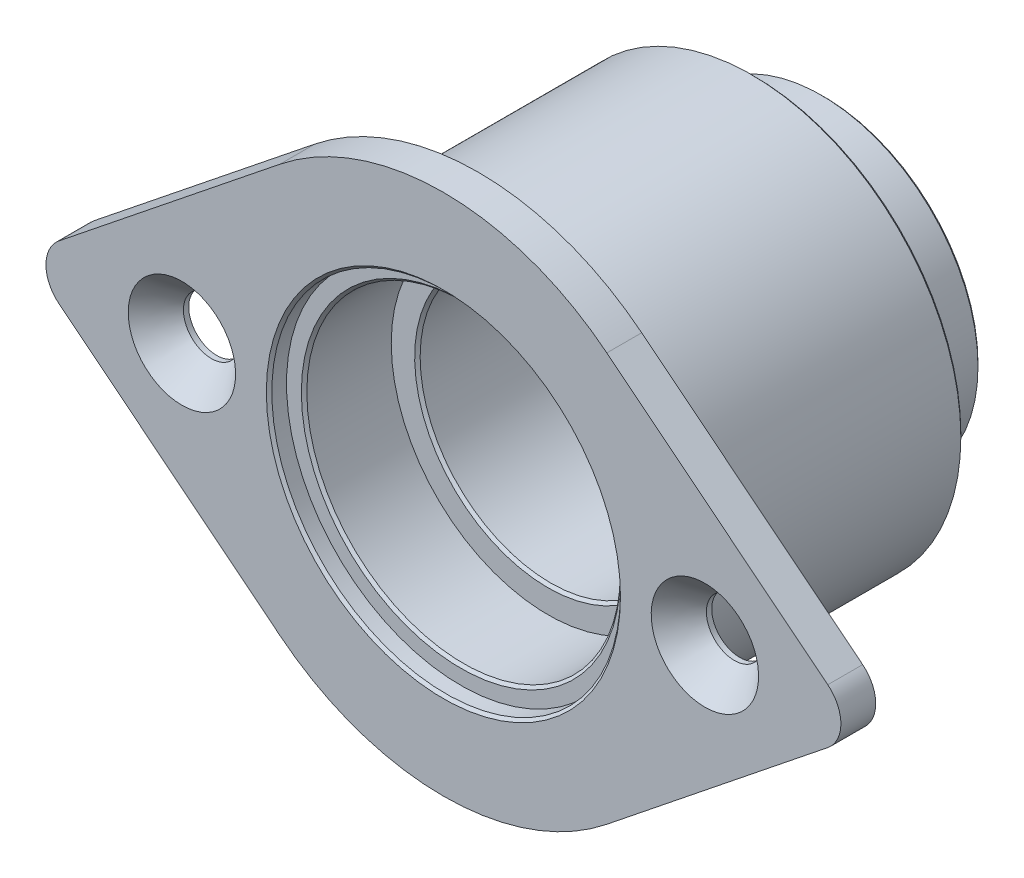
ISO-10303-21;
HEADER;
FILE_DESCRIPTION(('STEP AP214'),'2;1');
FILE_NAME('part.step','',(''),(''),'','','');
FILE_SCHEMA(('AUTOMOTIVE_DESIGN { 1 0 10303 214 1 1 1 1 }'));
ENDSEC;
DATA;
#1=APPLICATION_CONTEXT('core data for automotive mechanical design processes');
#2=APPLICATION_PROTOCOL_DEFINITION('international standard','automotive_design',2000,#1);
#3=PRODUCT_CONTEXT('',#1,'mechanical');
#4=PRODUCT('Part','Part','',(#3));
#5=PRODUCT_RELATED_PRODUCT_CATEGORY('part','',(#4));
#6=PRODUCT_DEFINITION_FORMATION('','',#4);
#7=PRODUCT_DEFINITION_CONTEXT('part definition',#1,'design');
#8=PRODUCT_DEFINITION('design','',#6,#7);
#9=PRODUCT_DEFINITION_SHAPE('','',#8);
#10=(LENGTH_UNIT() NAMED_UNIT(*) SI_UNIT(.MILLI.,.METRE.));
#11=(NAMED_UNIT(*) PLANE_ANGLE_UNIT() SI_UNIT($,.RADIAN.));
#12=(NAMED_UNIT(*) SI_UNIT($,.STERADIAN.) SOLID_ANGLE_UNIT());
#13=UNCERTAINTY_MEASURE_WITH_UNIT(LENGTH_MEASURE(1.E-05),#10,'distance_accuracy_value','');
#14=(GEOMETRIC_REPRESENTATION_CONTEXT(3) GLOBAL_UNCERTAINTY_ASSIGNED_CONTEXT((#13)) GLOBAL_UNIT_ASSIGNED_CONTEXT((#10,
#11,#12)) REPRESENTATION_CONTEXT('',''));
#15=CARTESIAN_POINT('',(0.,0.,0.));
#16=DIRECTION('',(0.,0.,1.));
#17=DIRECTION('',(1.,0.,0.));
#18=AXIS2_PLACEMENT_3D('',#15,#16,#17);
#19=CARTESIAN_POINT('',(0.,0.,-7.9375));
#20=DIRECTION('',(0.,0.,1.));
#21=DIRECTION('',(1.,0.,0.));
#22=AXIS2_PLACEMENT_3D('',#19,#20,#21);
#23=PLANE('',#22);
#24=CARTESIAN_POINT('',(0.,0.,-7.9375));
#25=DIRECTION('',(0.,0.,-1.));
#26=DIRECTION('',(-1.,0.,0.));
#27=AXIS2_PLACEMENT_3D('',#24,#25,#26);
#28=CIRCLE('',#27,14.2748);
#29=CARTESIAN_POINT('',(-14.2748,0.,-7.9375));
#30=VERTEX_POINT('',#29);
#31=EDGE_CURVE('E137',#30,#30,#28,.F.);
#32=ORIENTED_EDGE('',*,*,#31,.T.);
#33=EDGE_LOOP('',(#32));
#34=FACE_BOUND('',#33,.T.);
#35=CARTESIAN_POINT('',(0.,0.,-7.9375));
#36=DIRECTION('',(0.,0.,1.));
#37=DIRECTION('',(0.,-1.,0.));
#38=AXIS2_PLACEMENT_3D('',#35,#36,#37);
#39=CIRCLE('',#38,12.1435499999999);
#40=CARTESIAN_POINT('',(0.,-12.1435499999999,-7.9375));
#41=VERTEX_POINT('',#40);
#42=EDGE_CURVE('E21',#41,#41,#39,.F.);
#43=ORIENTED_EDGE('',*,*,#42,.T.);
#44=EDGE_LOOP('',(#43));
#45=FACE_BOUND('',#44,.T.);
#46=ADVANCED_FACE('F18',(#34,#45),#23,.T.);
#47=CARTESIAN_POINT('',(0.,0.,-7.9375));
#48=DIRECTION('',(0.,0.,1.));
#49=DIRECTION('',(0.,-1.,0.));
#50=AXIS2_PLACEMENT_3D('',#47,#48,#49);
#51=CONICAL_SURFACE('',#50,12.1435499999999,0.785398163397434);
#52=CARTESIAN_POINT('',(0.,0.,-8.18749999999995));
#53=DIRECTION('',(0.,0.,-1.));
#54=DIRECTION('',(-1.,0.,0.));
#55=AXIS2_PLACEMENT_3D('',#52,#53,#54);
#56=CIRCLE('',#55,11.89355);
#57=CARTESIAN_POINT('',(-11.89355,0.,-8.18749999999995));
#58=VERTEX_POINT('',#57);
#59=EDGE_CURVE('E135',#58,#58,#56,.T.);
#60=ORIENTED_EDGE('',*,*,#59,.T.);
#61=EDGE_LOOP('',(#60));
#62=FACE_BOUND('',#61,.T.);
#63=ORIENTED_EDGE('',*,*,#42,.F.);
#64=EDGE_LOOP('',(#63));
#65=FACE_BOUND('',#64,.T.);
#66=ADVANCED_FACE('F196',(#62,#65),#51,.F.);
#67=CARTESIAN_POINT('',(0.,0.,1.5875));
#68=DIRECTION('',(0.,0.,-1.));
#69=DIRECTION('',(-1.,0.,0.));
#70=AXIS2_PLACEMENT_3D('',#67,#68,#69);
#71=CYLINDRICAL_SURFACE('',#70,14.2748);
#72=CARTESIAN_POINT('',(0.,0.,-0.249999999999985));
#73=DIRECTION('',(0.,0.,1.));
#74=DIRECTION('',(1.,0.,0.));
#75=AXIS2_PLACEMENT_3D('',#72,#73,#74);
#76=CIRCLE('',#75,14.2748);
#77=CARTESIAN_POINT('',(14.2748,0.,-0.249999999999985));
#78=VERTEX_POINT('',#77);
#79=EDGE_CURVE('E132',#78,#78,#76,.T.);
#80=ORIENTED_EDGE('',*,*,#79,.T.);
#81=EDGE_LOOP('',(#80));
#82=FACE_BOUND('',#81,.T.);
#83=ORIENTED_EDGE('',*,*,#31,.F.);
#84=EDGE_LOOP('',(#83));
#85=FACE_BOUND('',#84,.T.);
#86=ADVANCED_FACE('F198',(#82,#85),#71,.F.);
#87=CARTESIAN_POINT('',(0.,0.,38.7877315203269));
#88=DIRECTION('',(0.,0.,-1.));
#89=DIRECTION('',(-1.,0.,0.));
#90=AXIS2_PLACEMENT_3D('',#87,#88,#89);
#91=CYLINDRICAL_SURFACE('',#90,11.89355);
#92=ORIENTED_EDGE('',*,*,#59,.F.);
#93=EDGE_LOOP('',(#92));
#94=FACE_BOUND('',#93,.T.);
#95=CARTESIAN_POINT('',(0.,0.,-32.8334999999999));
#96=DIRECTION('',(0.,0.,-1.));
#97=DIRECTION('',(-1.,0.,0.));
#98=AXIS2_PLACEMENT_3D('',#95,#96,#97);
#99=CIRCLE('',#98,11.89355);
#100=CARTESIAN_POINT('',(-11.89355,0.,-32.8334999999999));
#101=VERTEX_POINT('',#100);
#102=EDGE_CURVE('E128',#101,#101,#99,.T.);
#103=ORIENTED_EDGE('',*,*,#102,.T.);
#104=EDGE_LOOP('',(#103));
#105=FACE_BOUND('',#104,.T.);
#106=ADVANCED_FACE('F205',(#94,#105),#91,.F.);
#107=CARTESIAN_POINT('',(0.,0.,0.));
#108=DIRECTION('',(0.,0.,1.));
#109=DIRECTION('',(1.,0.,0.));
#110=AXIS2_PLACEMENT_3D('',#107,#108,#109);
#111=CONICAL_SURFACE('',#110,14.5248,0.785398163397459);
#112=ORIENTED_EDGE('',*,*,#79,.F.);
#113=EDGE_LOOP('',(#112));
#114=FACE_BOUND('',#113,.T.);
#115=CARTESIAN_POINT('',(0.,0.,0.));
#116=DIRECTION('',(0.,0.,1.));
#117=DIRECTION('',(1.,0.,0.));
#118=AXIS2_PLACEMENT_3D('',#115,#116,#117);
#119=CIRCLE('',#118,14.5248);
#120=CARTESIAN_POINT('',(14.5248,0.,0.));
#121=VERTEX_POINT('',#120);
#122=EDGE_CURVE('E131',#121,#121,#119,.F.);
#123=ORIENTED_EDGE('',*,*,#122,.F.);
#124=EDGE_LOOP('',(#123));
#125=FACE_BOUND('',#124,.T.);
#126=ADVANCED_FACE('F301',(#114,#125),#111,.F.);
#127=CARTESIAN_POINT('',(0.,0.,-33.0835));
#128=DIRECTION('',(0.,0.,-1.));
#129=DIRECTION('',(0.,1.,0.));
#130=AXIS2_PLACEMENT_3D('',#127,#128,#129);
#131=CONICAL_SURFACE('',#130,12.1435500000001,0.785398163397448);
#132=ORIENTED_EDGE('',*,*,#102,.F.);
#133=EDGE_LOOP('',(#132));
#134=FACE_BOUND('',#133,.T.);
#135=CARTESIAN_POINT('',(0.,0.,-33.0835));
#136=DIRECTION('',(0.,0.,-1.));
#137=DIRECTION('',(0.,1.,0.));
#138=AXIS2_PLACEMENT_3D('',#135,#136,#137);
#139=CIRCLE('',#138,12.1435500000001);
#140=CARTESIAN_POINT('',(0.,12.1435500000001,-33.0835));
#141=VERTEX_POINT('',#140);
#142=EDGE_CURVE('E185',#141,#141,#139,.F.);
#143=ORIENTED_EDGE('',*,*,#142,.F.);
#144=EDGE_LOOP('',(#143));
#145=FACE_BOUND('',#144,.T.);
#146=ADVANCED_FACE('F297',(#134,#145),#131,.F.);
#147=CARTESIAN_POINT('',(0.,0.,0.));
#148=DIRECTION('',(0.,0.,1.));
#149=DIRECTION('',(1.,0.,0.));
#150=AXIS2_PLACEMENT_3D('',#147,#148,#149);
#151=PLANE('',#150);
#152=CARTESIAN_POINT('',(0.,0.,0.));
#153=DIRECTION('',(0.,0.,1.));
#154=DIRECTION('',(1.,0.,0.));
#155=AXIS2_PLACEMENT_3D('',#152,#153,#154);
#156=CIRCLE('',#155,15.875);
#157=CARTESIAN_POINT('',(15.875,0.,0.));
#158=VERTEX_POINT('',#157);
#159=EDGE_CURVE('E182',#158,#158,#156,.T.);
#160=ORIENTED_EDGE('',*,*,#159,.T.);
#161=EDGE_LOOP('',(#160));
#162=FACE_BOUND('',#161,.T.);
#163=ORIENTED_EDGE('',*,*,#122,.T.);
#164=EDGE_LOOP('',(#163));
#165=FACE_BOUND('',#164,.T.);
#166=ADVANCED_FACE('F293',(#162,#165),#151,.T.);
#167=CARTESIAN_POINT('',(0.,0.,-33.0835));
#168=DIRECTION('',(0.,0.,-1.));
#169=DIRECTION('',(-1.,0.,0.));
#170=AXIS2_PLACEMENT_3D('',#167,#168,#169);
#171=PLANE('',#170);
#172=ORIENTED_EDGE('',*,*,#142,.T.);
#173=EDGE_LOOP('',(#172));
#174=FACE_BOUND('',#173,.T.);
#175=CARTESIAN_POINT('',(0.,0.,-33.0835));
#176=DIRECTION('',(0.,0.,1.));
#177=DIRECTION('',(1.,0.,0.));
#178=AXIS2_PLACEMENT_3D('',#175,#176,#177);
#179=CIRCLE('',#178,14.0121);
#180=CARTESIAN_POINT('',(14.0121,0.,-33.0835));
#181=VERTEX_POINT('',#180);
#182=EDGE_CURVE('E127',#181,#181,#179,.T.);
#183=ORIENTED_EDGE('',*,*,#182,.F.);
#184=EDGE_LOOP('',(#183));
#185=FACE_BOUND('',#184,.T.);
#186=ADVANCED_FACE('F289',(#174,#185),#171,.T.);
#187=CARTESIAN_POINT('',(0.,0.,0.));
#188=DIRECTION('',(0.,0.,1.));
#189=DIRECTION('',(1.,0.,0.));
#190=AXIS2_PLACEMENT_3D('',#187,#188,#189);
#191=CYLINDRICAL_SURFACE('',#190,15.875);
#192=ORIENTED_EDGE('',*,*,#159,.F.);
#193=EDGE_LOOP('',(#192));
#194=FACE_BOUND('',#193,.T.);
#195=CARTESIAN_POINT('',(0.,0.,1.3375));
#196=DIRECTION('',(0.,0.,1.));
#197=DIRECTION('',(1.,0.,0.));
#198=AXIS2_PLACEMENT_3D('',#195,#196,#197);
#199=CIRCLE('',#198,15.875);
#200=CARTESIAN_POINT('',(15.875,0.,1.3375));
#201=VERTEX_POINT('',#200);
#202=EDGE_CURVE('E124',#201,#201,#199,.T.);
#203=ORIENTED_EDGE('',*,*,#202,.T.);
#204=EDGE_LOOP('',(#203));
#205=FACE_BOUND('',#204,.T.);
#206=ADVANCED_FACE('F285',(#194,#205),#191,.F.);
#207=CARTESIAN_POINT('',(0.,0.,-32.8335));
#208=DIRECTION('',(0.,0.,1.));
#209=DIRECTION('',(1.,0.,0.));
#210=AXIS2_PLACEMENT_3D('',#207,#208,#209);
#211=CONICAL_SURFACE('',#210,14.2621,0.785398163397424);
#212=CARTESIAN_POINT('',(0.,0.,-32.8335));
#213=DIRECTION('',(0.,0.,-1.));
#214=DIRECTION('',(-1.,0.,0.));
#215=AXIS2_PLACEMENT_3D('',#212,#213,#214);
#216=CIRCLE('',#215,14.2621);
#217=CARTESIAN_POINT('',(-14.2621,0.,-32.8335));
#218=VERTEX_POINT('',#217);
#219=EDGE_CURVE('E120',#218,#218,#216,.F.);
#220=ORIENTED_EDGE('',*,*,#219,.F.);
#221=EDGE_LOOP('',(#220));
#222=FACE_BOUND('',#221,.T.);
#223=ORIENTED_EDGE('',*,*,#182,.T.);
#224=EDGE_LOOP('',(#223));
#225=FACE_BOUND('',#224,.T.);
#226=ADVANCED_FACE('F281',(#222,#225),#211,.T.);
#227=CARTESIAN_POINT('',(0.,0.,1.5875));
#228=DIRECTION('',(0.,0.,1.));
#229=DIRECTION('',(1.,0.,0.));
#230=AXIS2_PLACEMENT_3D('',#227,#228,#229);
#231=CONICAL_SURFACE('',#230,16.125,0.785398163397476);
#232=ORIENTED_EDGE('',*,*,#202,.F.);
#233=EDGE_LOOP('',(#232));
#234=FACE_BOUND('',#233,.T.);
#235=CARTESIAN_POINT('',(0.,0.,1.5875));
#236=DIRECTION('',(0.,0.,1.));
#237=DIRECTION('',(1.,0.,0.));
#238=AXIS2_PLACEMENT_3D('',#235,#236,#237);
#239=CIRCLE('',#238,16.125);
#240=CARTESIAN_POINT('',(16.125,0.,1.5875));
#241=VERTEX_POINT('',#240);
#242=EDGE_CURVE('E123',#241,#241,#239,.F.);
#243=ORIENTED_EDGE('',*,*,#242,.F.);
#244=EDGE_LOOP('',(#243));
#245=FACE_BOUND('',#244,.T.);
#246=ADVANCED_FACE('F277',(#234,#245),#231,.F.);
#247=CARTESIAN_POINT('',(0.,0.,27.1480367264149));
#248=DIRECTION('',(0.,0.,-1.));
#249=DIRECTION('',(-1.,0.,0.));
#250=AXIS2_PLACEMENT_3D('',#247,#248,#249);
#251=CYLINDRICAL_SURFACE('',#250,14.2621);
#252=ORIENTED_EDGE('',*,*,#219,.T.);
#253=EDGE_LOOP('',(#252));
#254=FACE_BOUND('',#253,.T.);
#255=CARTESIAN_POINT('',(0.,0.,-26.7335));
#256=DIRECTION('',(0.,0.,-1.));
#257=DIRECTION('',(-1.,0.,0.));
#258=AXIS2_PLACEMENT_3D('',#255,#256,#257);
#259=CIRCLE('',#258,14.2621);
#260=CARTESIAN_POINT('',(-14.2621,0.,-26.7335));
#261=VERTEX_POINT('',#260);
#262=EDGE_CURVE('E119',#261,#261,#259,.F.);
#263=ORIENTED_EDGE('',*,*,#262,.F.);
#264=EDGE_LOOP('',(#263));
#265=FACE_BOUND('',#264,.T.);
#266=ADVANCED_FACE('F273',(#254,#265),#251,.T.);
#267=CARTESIAN_POINT('',(-23.8125,0.,1.58749999997099));
#268=DIRECTION('',(0.,0.,1.));
#269=DIRECTION('',(0.,-1.,0.));
#270=AXIS2_PLACEMENT_3D('',#267,#268,#269);
#271=CONICAL_SURFACE('',#270,4.88949999997067,0.71558499333661);
#272=CARTESIAN_POINT('',(-23.8125,0.,-1.10068089399406));
#273=DIRECTION('',(0.,0.,1.));
#274=DIRECTION('',(1.,0.,0.));
#275=AXIS2_PLACEMENT_3D('',#272,#273,#274);
#276=CIRCLE('',#275,2.5527);
#277=CARTESIAN_POINT('',(-21.2598,0.,-1.10068089399406));
#278=VERTEX_POINT('',#277);
#279=EDGE_CURVE('E116',#278,#278,#276,.F.);
#280=ORIENTED_EDGE('',*,*,#279,.T.);
#281=EDGE_LOOP('',(#280));
#282=FACE_BOUND('',#281,.T.);
#283=CARTESIAN_POINT('',(-23.8125,0.,1.58749999997099));
#284=DIRECTION('',(0.,0.,1.));
#285=DIRECTION('',(0.,-1.,0.));
#286=AXIS2_PLACEMENT_3D('',#283,#284,#285);
#287=CIRCLE('',#286,4.88949999997067);
#288=CARTESIAN_POINT('',(-23.8125,-4.88949999997067,1.58749999997099));
#289=VERTEX_POINT('',#288);
#290=EDGE_CURVE('E175',#289,#289,#287,.F.);
#291=ORIENTED_EDGE('',*,*,#290,.F.);
#292=EDGE_LOOP('',(#291));
#293=FACE_BOUND('',#292,.T.);
#294=ADVANCED_FACE('F269',(#282,#293),#271,.F.);
#295=CARTESIAN_POINT('',(23.8125,0.,1.58749999997099));
#296=DIRECTION('',(0.,0.,1.));
#297=DIRECTION('',(0.,-1.,0.));
#298=AXIS2_PLACEMENT_3D('',#295,#296,#297);
#299=CONICAL_SURFACE('',#298,4.88949999995293,0.71558499333661);
#300=CARTESIAN_POINT('',(23.8125,0.,-1.10068089399406));
#301=DIRECTION('',(0.,0.,1.));
#302=DIRECTION('',(1.,0.,0.));
#303=AXIS2_PLACEMENT_3D('',#300,#301,#302);
#304=CIRCLE('',#303,2.5527);
#305=CARTESIAN_POINT('',(26.3652,0.,-1.10068089399406));
#306=VERTEX_POINT('',#305);
#307=EDGE_CURVE('E94',#306,#306,#304,.F.);
#308=ORIENTED_EDGE('',*,*,#307,.T.);
#309=EDGE_LOOP('',(#308));
#310=FACE_BOUND('',#309,.T.);
#311=CARTESIAN_POINT('',(23.8125,0.,1.58749999997099));
#312=DIRECTION('',(0.,0.,1.));
#313=DIRECTION('',(0.,-1.,0.));
#314=AXIS2_PLACEMENT_3D('',#311,#312,#313);
#315=CIRCLE('',#314,4.88949999995293);
#316=CARTESIAN_POINT('',(23.8125,-4.88949999995292,1.58749999997099));
#317=VERTEX_POINT('',#316);
#318=EDGE_CURVE('E172',#317,#317,#315,.F.);
#319=ORIENTED_EDGE('',*,*,#318,.F.);
#320=EDGE_LOOP('',(#319));
#321=FACE_BOUND('',#320,.T.);
#322=ADVANCED_FACE('F266',(#310,#321),#299,.F.);
#323=CARTESIAN_POINT('',(0.,0.,1.5875));
#324=DIRECTION('',(0.,0.,1.));
#325=DIRECTION('',(1.,0.,0.));
#326=AXIS2_PLACEMENT_3D('',#323,#324,#325);
#327=PLANE('',#326);
#328=DIRECTION('',(-0.7806247497998,0.625,0.));
#329=VECTOR('',#328,1.);
#330=CARTESIAN_POINT('',(-14.8828125,-18.5886268546077,1.5875));
#331=LINE('',#330,#329);
#332=CARTESIAN_POINT('',(-35.004375,-2.47848358061436,1.5875));
#333=VERTEX_POINT('',#332);
#334=CARTESIAN_POINT('',(-14.8828125,-18.5886268546077,1.5875));
#335=VERTEX_POINT('',#334);
#336=EDGE_CURVE('E112',#333,#335,#331,.F.);
#337=ORIENTED_EDGE('',*,*,#336,.T.);
#338=CARTESIAN_POINT('',(0.,0.,1.5875));
#339=DIRECTION('',(0.,0.,-1.));
#340=DIRECTION('',(-1.,0.,0.));
#341=AXIS2_PLACEMENT_3D('',#338,#339,#340);
#342=CIRCLE('',#341,23.8125);
#343=CARTESIAN_POINT('',(14.8828125,-18.5886268546077,1.5875));
#344=VERTEX_POINT('',#343);
#345=EDGE_CURVE('E164',#344,#335,#342,.T.);
#346=ORIENTED_EDGE('',*,*,#345,.F.);
#347=DIRECTION('',(0.7806247497998,0.625,0.));
#348=VECTOR('',#347,1.);
#349=CARTESIAN_POINT('',(14.8828125,-18.5886268546077,1.5875));
#350=LINE('',#349,#348);
#351=CARTESIAN_POINT('',(35.004375,-2.47848358061437,1.5875));
#352=VERTEX_POINT('',#351);
#353=EDGE_CURVE('E526',#352,#344,#350,.F.);
#354=ORIENTED_EDGE('',*,*,#353,.F.);
#355=CARTESIAN_POINT('',(33.02,0.,1.5875));
#356=DIRECTION('',(0.,0.,-1.));
#357=DIRECTION('',(-1.,0.,0.));
#358=AXIS2_PLACEMENT_3D('',#355,#356,#357);
#359=CIRCLE('',#358,3.175);
#360=CARTESIAN_POINT('',(35.004375,2.47848358061436,1.5875));
#361=VERTEX_POINT('',#360);
#362=EDGE_CURVE('E159',#361,#352,#359,.T.);
#363=ORIENTED_EDGE('',*,*,#362,.F.);
#364=DIRECTION('',(-0.7806247497998,0.625,0.));
#365=VECTOR('',#364,1.);
#366=CARTESIAN_POINT('',(14.8828125,18.5886268546077,1.5875));
#367=LINE('',#366,#365);
#368=CARTESIAN_POINT('',(14.8828125,18.5886268546077,1.5875));
#369=VERTEX_POINT('',#368);
#370=EDGE_CURVE('E90',#369,#361,#367,.F.);
#371=ORIENTED_EDGE('',*,*,#370,.F.);
#372=CARTESIAN_POINT('',(0.,0.,1.5875));
#373=DIRECTION('',(0.,0.,-1.));
#374=DIRECTION('',(-1.,0.,0.));
#375=AXIS2_PLACEMENT_3D('',#372,#373,#374);
#376=CIRCLE('',#375,23.8125);
#377=CARTESIAN_POINT('',(-14.8828125,18.5886268546077,1.5875));
#378=VERTEX_POINT('',#377);
#379=EDGE_CURVE('E82',#378,#369,#376,.T.);
#380=ORIENTED_EDGE('',*,*,#379,.F.);
#381=DIRECTION('',(0.7806247497998,0.625,0.));
#382=VECTOR('',#381,1.);
#383=CARTESIAN_POINT('',(-14.8828125,18.5886268546077,1.5875));
#384=LINE('',#383,#382);
#385=CARTESIAN_POINT('',(-35.004375,2.47848358061436,1.5875));
#386=VERTEX_POINT('',#385);
#387=EDGE_CURVE('E87',#378,#386,#384,.F.);
#388=ORIENTED_EDGE('',*,*,#387,.T.);
#389=CARTESIAN_POINT('',(-33.02,0.,1.5875));
#390=DIRECTION('',(0.,0.,-1.));
#391=DIRECTION('',(-1.,0.,0.));
#392=AXIS2_PLACEMENT_3D('',#389,#390,#391);
#393=CIRCLE('',#392,3.175);
#394=EDGE_CURVE('E108',#333,#386,#393,.T.);
#395=ORIENTED_EDGE('',*,*,#394,.F.);
#396=EDGE_LOOP('',(#337,#346,#354,#363,#371,#380,#388,#395));
#397=FACE_BOUND('',#396,.T.);
#398=ORIENTED_EDGE('',*,*,#318,.T.);
#399=EDGE_LOOP('',(#398));
#400=FACE_BOUND('',#399,.T.);
#401=ORIENTED_EDGE('',*,*,#290,.T.);
#402=EDGE_LOOP('',(#401));
#403=FACE_BOUND('',#402,.T.);
#404=ORIENTED_EDGE('',*,*,#242,.T.);
#405=EDGE_LOOP('',(#404));
#406=FACE_BOUND('',#405,.T.);
#407=ADVANCED_FACE('F84',(#397,#400,#403,#406),#327,.T.);
#408=CARTESIAN_POINT('',(0.,0.,-26.7335));
#409=DIRECTION('',(0.,0.,-1.));
#410=DIRECTION('',(-1.,0.,0.));
#411=AXIS2_PLACEMENT_3D('',#408,#409,#410);
#412=PLANE('',#411);
#413=ORIENTED_EDGE('',*,*,#262,.T.);
#414=EDGE_LOOP('',(#413));
#415=FACE_BOUND('',#414,.T.);
#416=CARTESIAN_POINT('',(0.,0.,-26.7335));
#417=DIRECTION('',(0.,0.,1.));
#418=DIRECTION('',(1.,0.,0.));
#419=AXIS2_PLACEMENT_3D('',#416,#417,#418);
#420=CIRCLE('',#419,18.8);
#421=CARTESIAN_POINT('',(18.8,0.,-26.7335));
#422=VERTEX_POINT('',#421);
#423=EDGE_CURVE('E155',#422,#422,#420,.T.);
#424=ORIENTED_EDGE('',*,*,#423,.F.);
#425=EDGE_LOOP('',(#424));
#426=FACE_BOUND('',#425,.T.);
#427=ADVANCED_FACE('F259',(#415,#426),#412,.T.);
#428=CARTESIAN_POINT('',(-23.8125,0.,1.5875));
#429=DIRECTION('',(0.,0.,1.));
#430=DIRECTION('',(1.,0.,0.));
#431=AXIS2_PLACEMENT_3D('',#428,#429,#430);
#432=CYLINDRICAL_SURFACE('',#431,2.5527);
#433=CARTESIAN_POINT('',(-23.8125,0.,-1.5875));
#434=DIRECTION('',(0.,0.,1.));
#435=DIRECTION('',(1.,0.,0.));
#436=AXIS2_PLACEMENT_3D('',#433,#434,#435);
#437=CIRCLE('',#436,2.5527);
#438=CARTESIAN_POINT('',(-21.2598,0.,-1.5875));
#439=VERTEX_POINT('',#438);
#440=EDGE_CURVE('E152',#439,#439,#437,.F.);
#441=ORIENTED_EDGE('',*,*,#440,.T.);
#442=EDGE_LOOP('',(#441));
#443=FACE_BOUND('',#442,.T.);
#444=ORIENTED_EDGE('',*,*,#279,.F.);
#445=EDGE_LOOP('',(#444));
#446=FACE_BOUND('',#445,.T.);
#447=ADVANCED_FACE('F255',(#443,#446),#432,.F.);
#448=CARTESIAN_POINT('',(23.8125,0.,1.5875));
#449=DIRECTION('',(0.,0.,1.));
#450=DIRECTION('',(1.,0.,0.));
#451=AXIS2_PLACEMENT_3D('',#448,#449,#450);
#452=CYLINDRICAL_SURFACE('',#451,2.5527);
#453=CARTESIAN_POINT('',(23.8125,0.,-1.5875));
#454=DIRECTION('',(0.,0.,1.));
#455=DIRECTION('',(1.,0.,0.));
#456=AXIS2_PLACEMENT_3D('',#453,#454,#455);
#457=CIRCLE('',#456,2.5527);
#458=CARTESIAN_POINT('',(26.3652,0.,-1.5875));
#459=VERTEX_POINT('',#458);
#460=EDGE_CURVE('E149',#459,#459,#457,.F.);
#461=ORIENTED_EDGE('',*,*,#460,.T.);
#462=EDGE_LOOP('',(#461));
#463=FACE_BOUND('',#462,.T.);
#464=ORIENTED_EDGE('',*,*,#307,.F.);
#465=EDGE_LOOP('',(#464));
#466=FACE_BOUND('',#465,.T.);
#467=ADVANCED_FACE('F252',(#463,#466),#452,.F.);
#468=CARTESIAN_POINT('',(0.,0.,1.5875));
#469=DIRECTION('',(0.,0.,-1.));
#470=DIRECTION('',(-1.,0.,0.));
#471=AXIS2_PLACEMENT_3D('',#468,#469,#470);
#472=CYLINDRICAL_SURFACE('',#471,23.8125);
#473=ORIENTED_EDGE('',*,*,#379,.T.);
#474=DIRECTION('',(0.,0.,1.));
#475=VECTOR('',#474,1.);
#476=CARTESIAN_POINT('',(14.8828125,18.5886268546077,1.5875));
#477=LINE('',#476,#475);
#478=CARTESIAN_POINT('',(14.8828125,18.5886268546077,-1.5875));
#479=VERTEX_POINT('',#478);
#480=EDGE_CURVE('E158',#479,#369,#477,.T.);
#481=ORIENTED_EDGE('',*,*,#480,.F.);
#482=CARTESIAN_POINT('',(0.,0.,-1.5875));
#483=DIRECTION('',(0.,0.,-1.));
#484=DIRECTION('',(-1.,0.,0.));
#485=AXIS2_PLACEMENT_3D('',#482,#483,#484);
#486=CIRCLE('',#485,23.8125);
#487=CARTESIAN_POINT('',(-14.8828125,18.5886268546077,-1.5875));
#488=VERTEX_POINT('',#487);
#489=EDGE_CURVE('E99',#479,#488,#486,.F.);
#490=ORIENTED_EDGE('',*,*,#489,.T.);
#491=DIRECTION('',(0.,0.,1.));
#492=VECTOR('',#491,1.);
#493=CARTESIAN_POINT('',(-14.8828125,18.5886268546077,1.5875));
#494=LINE('',#493,#492);
#495=EDGE_CURVE('E93',#488,#378,#494,.T.);
#496=ORIENTED_EDGE('',*,*,#495,.T.);
#497=EDGE_LOOP('',(#473,#481,#490,#496));
#498=FACE_BOUND('',#497,.T.);
#499=ADVANCED_FACE('F97',(#498),#472,.T.);
#500=CARTESIAN_POINT('',(-14.8828125,18.5886268546077,1.5875));
#501=DIRECTION('',(0.625,-0.7806247497998,0.));
#502=DIRECTION('',(0.7806247497998,0.625,0.));
#503=AXIS2_PLACEMENT_3D('',#500,#501,#502);
#504=PLANE('',#503);
#505=DIRECTION('',(0.,0.,-1.));
#506=VECTOR('',#505,1.);
#507=CARTESIAN_POINT('',(-35.004375,2.47848358061435,1.5875));
#508=LINE('',#507,#506);
#509=CARTESIAN_POINT('',(-35.004375,2.47848358061436,-1.5875));
#510=VERTEX_POINT('',#509);
#511=EDGE_CURVE('E106',#386,#510,#508,.T.);
#512=ORIENTED_EDGE('',*,*,#511,.F.);
#513=ORIENTED_EDGE('',*,*,#387,.F.);
#514=ORIENTED_EDGE('',*,*,#495,.F.);
#515=DIRECTION('',(-0.7806247497998,-0.625,0.));
#516=VECTOR('',#515,1.);
#517=CARTESIAN_POINT('',(-14.8828125,18.5886268546077,-1.5875));
#518=LINE('',#517,#516);
#519=EDGE_CURVE('E147',#488,#510,#518,.T.);
#520=ORIENTED_EDGE('',*,*,#519,.T.);
#521=EDGE_LOOP('',(#512,#513,#514,#520));
#522=FACE_BOUND('',#521,.T.);
#523=ADVANCED_FACE('F104',(#522),#504,.F.);
#524=CARTESIAN_POINT('',(-33.02,0.,1.5875));
#525=DIRECTION('',(0.,0.,-1.));
#526=DIRECTION('',(-1.,0.,0.));
#527=AXIS2_PLACEMENT_3D('',#524,#525,#526);
#528=CYLINDRICAL_SURFACE('',#527,3.175);
#529=CARTESIAN_POINT('',(-33.02,0.,-1.5875));
#530=DIRECTION('',(0.,0.,-1.));
#531=DIRECTION('',(-1.,0.,0.));
#532=AXIS2_PLACEMENT_3D('',#529,#530,#531);
#533=CIRCLE('',#532,3.175);
#534=CARTESIAN_POINT('',(-35.004375,-2.47848358061437,-1.5875));
#535=VERTEX_POINT('',#534);
#536=EDGE_CURVE('E145',#510,#535,#533,.F.);
#537=ORIENTED_EDGE('',*,*,#536,.T.);
#538=DIRECTION('',(0.,0.,1.));
#539=VECTOR('',#538,1.);
#540=CARTESIAN_POINT('',(-35.004375,-2.47848358061437,1.5875));
#541=LINE('',#540,#539);
#542=EDGE_CURVE('E168',#535,#333,#541,.T.);
#543=ORIENTED_EDGE('',*,*,#542,.T.);
#544=ORIENTED_EDGE('',*,*,#394,.T.);
#545=ORIENTED_EDGE('',*,*,#511,.T.);
#546=EDGE_LOOP('',(#537,#543,#544,#545));
#547=FACE_BOUND('',#546,.T.);
#548=ADVANCED_FACE('F243',(#547),#528,.T.);
#549=CARTESIAN_POINT('',(-14.8828125,-18.5886268546077,1.5875));
#550=DIRECTION('',(0.625,0.7806247497998,0.));
#551=DIRECTION('',(-0.7806247497998,0.625,0.));
#552=AXIS2_PLACEMENT_3D('',#549,#550,#551);
#553=PLANE('',#552);
#554=ORIENTED_EDGE('',*,*,#542,.F.);
#555=DIRECTION('',(0.7806247497998,-0.625,0.));
#556=VECTOR('',#555,1.);
#557=CARTESIAN_POINT('',(-35.004375,-2.47848358061437,-1.5875));
#558=LINE('',#557,#556);
#559=CARTESIAN_POINT('',(-14.8828125,-18.5886268546077,-1.5875));
#560=VERTEX_POINT('',#559);
#561=EDGE_CURVE('E144',#535,#560,#558,.T.);
#562=ORIENTED_EDGE('',*,*,#561,.T.);
#563=DIRECTION('',(0.,0.,-1.));
#564=VECTOR('',#563,1.);
#565=CARTESIAN_POINT('',(-14.8828125,-18.5886268546077,1.5875));
#566=LINE('',#565,#564);
#567=EDGE_CURVE('E167',#335,#560,#566,.T.);
#568=ORIENTED_EDGE('',*,*,#567,.F.);
#569=ORIENTED_EDGE('',*,*,#336,.F.);
#570=EDGE_LOOP('',(#554,#562,#568,#569));
#571=FACE_BOUND('',#570,.T.);
#572=ADVANCED_FACE('F239',(#571),#553,.F.);
#573=CARTESIAN_POINT('',(0.,0.,1.5875));
#574=DIRECTION('',(0.,0.,-1.));
#575=DIRECTION('',(-1.,0.,0.));
#576=AXIS2_PLACEMENT_3D('',#573,#574,#575);
#577=CYLINDRICAL_SURFACE('',#576,23.8125);
#578=ORIENTED_EDGE('',*,*,#345,.T.);
#579=ORIENTED_EDGE('',*,*,#567,.T.);
#580=CARTESIAN_POINT('',(0.,0.,-1.5875));
#581=DIRECTION('',(0.,0.,-1.));
#582=DIRECTION('',(-1.,0.,0.));
#583=AXIS2_PLACEMENT_3D('',#580,#581,#582);
#584=CIRCLE('',#583,23.8125);
#585=CARTESIAN_POINT('',(14.8828125,-18.5886268546077,-1.5875));
#586=VERTEX_POINT('',#585);
#587=EDGE_CURVE('E142',#560,#586,#584,.F.);
#588=ORIENTED_EDGE('',*,*,#587,.T.);
#589=DIRECTION('',(0.,0.,1.));
#590=VECTOR('',#589,1.);
#591=CARTESIAN_POINT('',(14.8828125,-18.5886268546077,1.5875));
#592=LINE('',#591,#590);
#593=EDGE_CURVE('E163',#344,#586,#592,.F.);
#594=ORIENTED_EDGE('',*,*,#593,.F.);
#595=EDGE_LOOP('',(#578,#579,#588,#594));
#596=FACE_BOUND('',#595,.T.);
#597=ADVANCED_FACE('F235',(#596),#577,.T.);
#598=CARTESIAN_POINT('',(14.8828125,-18.5886268546077,1.5875));
#599=DIRECTION('',(0.625,-0.7806247497998,0.));
#600=DIRECTION('',(0.7806247497998,0.625,0.));
#601=AXIS2_PLACEMENT_3D('',#598,#599,#600);
#602=PLANE('',#601);
#603=ORIENTED_EDGE('',*,*,#353,.T.);
#604=ORIENTED_EDGE('',*,*,#593,.T.);
#605=DIRECTION('',(0.7806247497998,0.625,0.));
#606=VECTOR('',#605,1.);
#607=CARTESIAN_POINT('',(14.8828125,-18.5886268546077,-1.5875));
#608=LINE('',#607,#606);
#609=CARTESIAN_POINT('',(35.004375,-2.47848358061437,-1.5875));
#610=VERTEX_POINT('',#609);
#611=EDGE_CURVE('E141',#586,#610,#608,.T.);
#612=ORIENTED_EDGE('',*,*,#611,.T.);
#613=DIRECTION('',(0.,0.,-1.));
#614=VECTOR('',#613,1.);
#615=CARTESIAN_POINT('',(35.004375,-2.47848358061437,1.5875));
#616=LINE('',#615,#614);
#617=EDGE_CURVE('E162',#352,#610,#616,.T.);
#618=ORIENTED_EDGE('',*,*,#617,.F.);
#619=EDGE_LOOP('',(#603,#604,#612,#618));
#620=FACE_BOUND('',#619,.T.);
#621=ADVANCED_FACE('F232',(#620),#602,.T.);
#622=CARTESIAN_POINT('',(33.02,0.,1.5875));
#623=DIRECTION('',(0.,0.,-1.));
#624=DIRECTION('',(-1.,0.,0.));
#625=AXIS2_PLACEMENT_3D('',#622,#623,#624);
#626=CYLINDRICAL_SURFACE('',#625,3.175);
#627=CARTESIAN_POINT('',(33.02,0.,-1.5875));
#628=DIRECTION('',(0.,0.,-1.));
#629=DIRECTION('',(-1.,0.,0.));
#630=AXIS2_PLACEMENT_3D('',#627,#628,#629);
#631=CIRCLE('',#630,3.175);
#632=CARTESIAN_POINT('',(35.004375,2.47848358061436,-1.5875));
#633=VERTEX_POINT('',#632);
#634=EDGE_CURVE('E36',#610,#633,#631,.F.);
#635=ORIENTED_EDGE('',*,*,#634,.T.);
#636=DIRECTION('',(0.,0.,1.));
#637=VECTOR('',#636,1.);
#638=CARTESIAN_POINT('',(35.004375,2.47848358061436,1.5875));
#639=LINE('',#638,#637);
#640=EDGE_CURVE('E520',#361,#633,#639,.F.);
#641=ORIENTED_EDGE('',*,*,#640,.F.);
#642=ORIENTED_EDGE('',*,*,#362,.T.);
#643=ORIENTED_EDGE('',*,*,#617,.T.);
#644=EDGE_LOOP('',(#635,#641,#642,#643));
#645=FACE_BOUND('',#644,.T.);
#646=ADVANCED_FACE('F228',(#645),#626,.T.);
#647=CARTESIAN_POINT('',(14.8828125,18.5886268546077,1.5875));
#648=DIRECTION('',(0.625,0.7806247497998,0.));
#649=DIRECTION('',(-0.7806247497998,0.625,0.));
#650=AXIS2_PLACEMENT_3D('',#647,#648,#649);
#651=PLANE('',#650);
#652=DIRECTION('',(-0.7806247497998,0.625,0.));
#653=VECTOR('',#652,1.);
#654=CARTESIAN_POINT('',(35.004375,2.47848358061437,-1.5875));
#655=LINE('',#654,#653);
#656=EDGE_CURVE('E140',#633,#479,#655,.T.);
#657=ORIENTED_EDGE('',*,*,#656,.T.);
#658=ORIENTED_EDGE('',*,*,#480,.T.);
#659=ORIENTED_EDGE('',*,*,#370,.T.);
#660=ORIENTED_EDGE('',*,*,#640,.T.);
#661=EDGE_LOOP('',(#657,#658,#659,#660));
#662=FACE_BOUND('',#661,.T.);
#663=ADVANCED_FACE('F224',(#662),#651,.T.);
#664=CARTESIAN_POINT('',(0.,0.,-26.4835));
#665=DIRECTION('',(0.,0.,1.));
#666=DIRECTION('',(1.,0.,0.));
#667=AXIS2_PLACEMENT_3D('',#664,#665,#666);
#668=CONICAL_SURFACE('',#667,19.05,0.785398163397434);
#669=ORIENTED_EDGE('',*,*,#423,.T.);
#670=EDGE_LOOP('',(#669));
#671=FACE_BOUND('',#670,.T.);
#672=CARTESIAN_POINT('',(0.,0.,-26.4835));
#673=DIRECTION('',(0.,0.,1.));
#674=DIRECTION('',(1.,0.,0.));
#675=AXIS2_PLACEMENT_3D('',#672,#673,#674);
#676=CIRCLE('',#675,19.05);
#677=CARTESIAN_POINT('',(19.05,0.,-26.4835));
#678=VERTEX_POINT('',#677);
#679=EDGE_CURVE('E27',#678,#678,#676,.T.);
#680=ORIENTED_EDGE('',*,*,#679,.F.);
#681=EDGE_LOOP('',(#680));
#682=FACE_BOUND('',#681,.T.);
#683=ADVANCED_FACE('F216',(#671,#682),#668,.T.);
#684=CARTESIAN_POINT('',(0.,0.,-1.5875));
#685=DIRECTION('',(0.,0.,1.));
#686=DIRECTION('',(1.,0.,0.));
#687=AXIS2_PLACEMENT_3D('',#684,#685,#686);
#688=PLANE('',#687);
#689=CARTESIAN_POINT('',(0.,0.,-1.5875));
#690=DIRECTION('',(0.,0.,1.));
#691=DIRECTION('',(1.,0.,0.));
#692=AXIS2_PLACEMENT_3D('',#689,#690,#691);
#693=CIRCLE('',#692,19.05);
#694=CARTESIAN_POINT('',(19.05,0.,-1.5875));
#695=VERTEX_POINT('',#694);
#696=EDGE_CURVE('E11',#695,#695,#693,.F.);
#697=ORIENTED_EDGE('',*,*,#696,.F.);
#698=EDGE_LOOP('',(#697));
#699=FACE_BOUND('',#698,.T.);
#700=ORIENTED_EDGE('',*,*,#634,.F.);
#701=ORIENTED_EDGE('',*,*,#611,.F.);
#702=ORIENTED_EDGE('',*,*,#587,.F.);
#703=ORIENTED_EDGE('',*,*,#561,.F.);
#704=ORIENTED_EDGE('',*,*,#536,.F.);
#705=ORIENTED_EDGE('',*,*,#519,.F.);
#706=ORIENTED_EDGE('',*,*,#489,.F.);
#707=ORIENTED_EDGE('',*,*,#656,.F.);
#708=EDGE_LOOP('',(#700,#701,#702,#703,#704,#705,#706,#707));
#709=FACE_BOUND('',#708,.T.);
#710=ORIENTED_EDGE('',*,*,#460,.F.);
#711=EDGE_LOOP('',(#710));
#712=FACE_BOUND('',#711,.T.);
#713=ORIENTED_EDGE('',*,*,#440,.F.);
#714=EDGE_LOOP('',(#713));
#715=FACE_BOUND('',#714,.T.);
#716=ADVANCED_FACE('F210',(#699,#709,#712,#715),#688,.F.);
#717=CARTESIAN_POINT('',(0.,0.,-26.7335));
#718=DIRECTION('',(0.,0.,1.));
#719=DIRECTION('',(1.,0.,0.));
#720=AXIS2_PLACEMENT_3D('',#717,#718,#719);
#721=CYLINDRICAL_SURFACE('',#720,19.05);
#722=ORIENTED_EDGE('',*,*,#679,.T.);
#723=EDGE_LOOP('',(#722));
#724=FACE_BOUND('',#723,.T.);
#725=ORIENTED_EDGE('',*,*,#696,.T.);
#726=EDGE_LOOP('',(#725));
#727=FACE_BOUND('',#726,.T.);
#728=ADVANCED_FACE('F208',(#724,#727),#721,.T.);
#729=CLOSED_SHELL('',(#46,#66,#86,#106,#126,#146,#166,#186,#206,#226,#246,#266,#294,#322,#407,
#427,#447,#467,#499,#523,#548,#572,#597,#621,#646,#663,#683,#716,#728));
#730=MANIFOLD_SOLID_BREP('B1',#729);
#731=ADVANCED_BREP_SHAPE_REPRESENTATION('',(#18,#730),#14);
#732=SHAPE_DEFINITION_REPRESENTATION(#9,#731);
ENDSEC;
END-ISO-10303-21;
